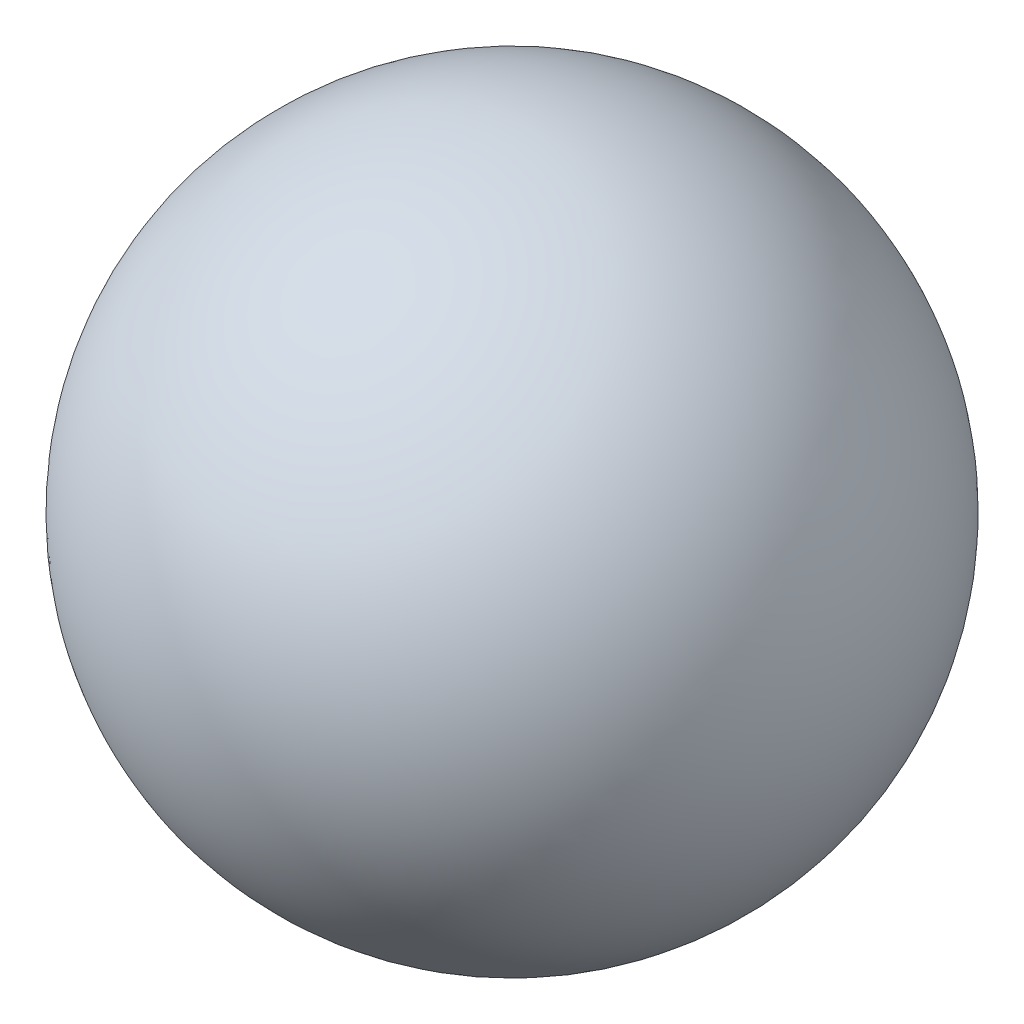
ISO-10303-21;
HEADER;
FILE_DESCRIPTION(('STEP AP214'),'2;1');
FILE_NAME('part.step','',(''),(''),'','','');
FILE_SCHEMA(('AUTOMOTIVE_DESIGN { 1 0 10303 214 1 1 1 1 }'));
ENDSEC;
DATA;
#1=APPLICATION_CONTEXT('core data for automotive mechanical design processes');
#2=APPLICATION_PROTOCOL_DEFINITION('international standard','automotive_design',2000,#1);
#3=PRODUCT_CONTEXT('',#1,'mechanical');
#4=PRODUCT('Part','Part','',(#3));
#5=PRODUCT_RELATED_PRODUCT_CATEGORY('part','',(#4));
#6=PRODUCT_DEFINITION_FORMATION('','',#4);
#7=PRODUCT_DEFINITION_CONTEXT('part definition',#1,'design');
#8=PRODUCT_DEFINITION('design','',#6,#7);
#9=PRODUCT_DEFINITION_SHAPE('','',#8);
#10=(LENGTH_UNIT() NAMED_UNIT(*) SI_UNIT(.MILLI.,.METRE.));
#11=(NAMED_UNIT(*) PLANE_ANGLE_UNIT() SI_UNIT($,.RADIAN.));
#12=(NAMED_UNIT(*) SI_UNIT($,.STERADIAN.) SOLID_ANGLE_UNIT());
#13=UNCERTAINTY_MEASURE_WITH_UNIT(LENGTH_MEASURE(1.E-05),#10,'distance_accuracy_value','');
#14=(GEOMETRIC_REPRESENTATION_CONTEXT(3) GLOBAL_UNCERTAINTY_ASSIGNED_CONTEXT((#13)) GLOBAL_UNIT_ASSIGNED_CONTEXT((#10,
#11,#12)) REPRESENTATION_CONTEXT('',''));
#15=CARTESIAN_POINT('',(0.,0.,0.));
#16=DIRECTION('',(0.,0.,1.));
#17=DIRECTION('',(1.,0.,0.));
#18=AXIS2_PLACEMENT_3D('',#15,#16,#17);
#19=CARTESIAN_POINT('',(3.5,7.35,0.));
#20=DIRECTION('',(0.,0.,1.));
#21=DIRECTION('',(-1.,0.,0.));
#22=AXIS2_PLACEMENT_3D('',#19,#20,#21);
#23=SPHERICAL_SURFACE('',#22,1.9845);
#24=CARTESIAN_POINT('',(3.5,7.35,-1.9845));
#25=VERTEX_POINT('',#24);
#26=VERTEX_LOOP('',#25);
#27=FACE_BOUND('',#26,.T.);
#28=CARTESIAN_POINT('',(3.5,7.35,1.9845));
#29=VERTEX_POINT('',#28);
#30=VERTEX_LOOP('',#29);
#31=FACE_BOUND('',#30,.T.);
#32=ADVANCED_FACE('F15',(#27,#31),#23,.T.);
#33=CLOSED_SHELL('',(#32));
#34=MANIFOLD_SOLID_BREP('B1',#33);
#35=ADVANCED_BREP_SHAPE_REPRESENTATION('',(#18,#34),#14);
#36=SHAPE_DEFINITION_REPRESENTATION(#9,#35);
ENDSEC;
END-ISO-10303-21;
